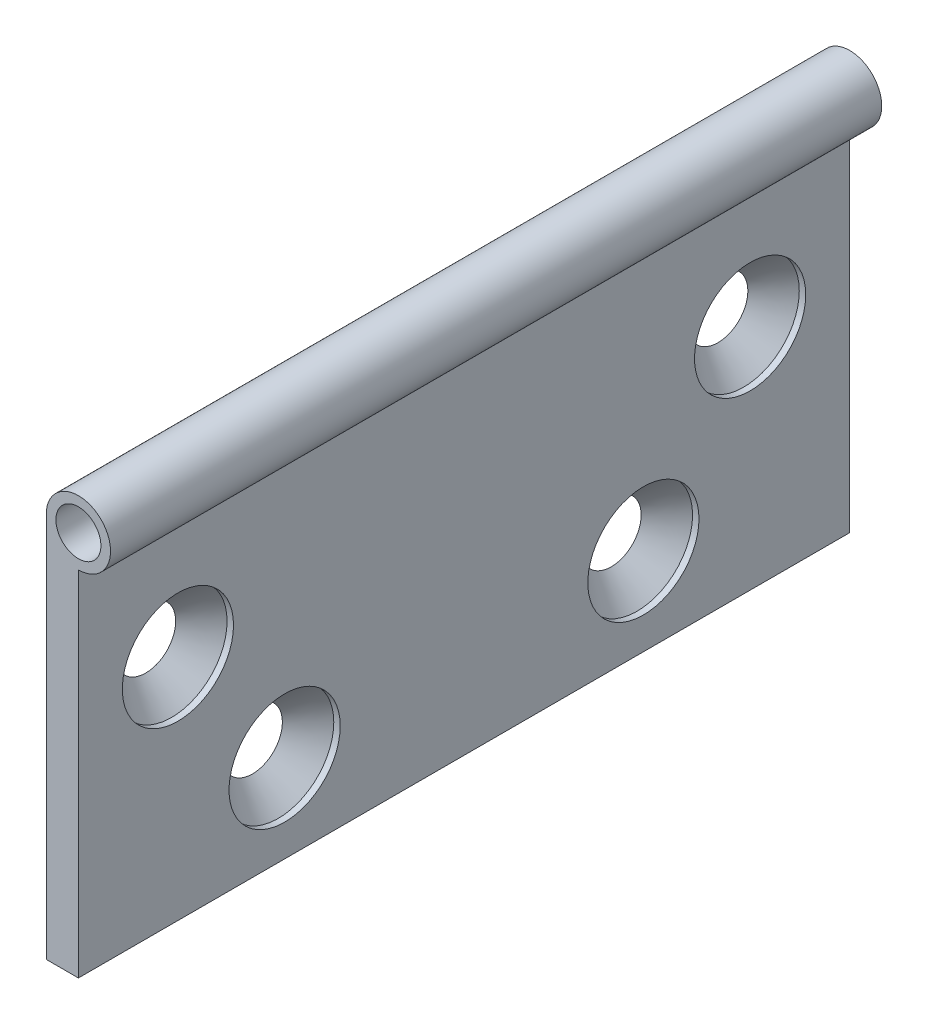
ISO-10303-21;
HEADER;
FILE_DESCRIPTION(('STEP AP214'),'2;1');
FILE_NAME('part.step','',(''),(''),'','','');
FILE_SCHEMA(('AUTOMOTIVE_DESIGN { 1 0 10303 214 1 1 1 1 }'));
ENDSEC;
DATA;
#1=APPLICATION_CONTEXT('core data for automotive mechanical design processes');
#2=APPLICATION_PROTOCOL_DEFINITION('international standard','automotive_design',2000,#1);
#3=PRODUCT_CONTEXT('',#1,'mechanical');
#4=PRODUCT('Part','Part','',(#3));
#5=PRODUCT_RELATED_PRODUCT_CATEGORY('part','',(#4));
#6=PRODUCT_DEFINITION_FORMATION('','',#4);
#7=PRODUCT_DEFINITION_CONTEXT('part definition',#1,'design');
#8=PRODUCT_DEFINITION('design','',#6,#7);
#9=PRODUCT_DEFINITION_SHAPE('','',#8);
#10=(LENGTH_UNIT() NAMED_UNIT(*) SI_UNIT(.MILLI.,.METRE.));
#11=(NAMED_UNIT(*) PLANE_ANGLE_UNIT() SI_UNIT($,.RADIAN.));
#12=(NAMED_UNIT(*) SI_UNIT($,.STERADIAN.) SOLID_ANGLE_UNIT());
#13=UNCERTAINTY_MEASURE_WITH_UNIT(LENGTH_MEASURE(1.E-05),#10,'distance_accuracy_value','');
#14=(GEOMETRIC_REPRESENTATION_CONTEXT(3) GLOBAL_UNCERTAINTY_ASSIGNED_CONTEXT((#13)) GLOBAL_UNIT_ASSIGNED_CONTEXT((#10,
#11,#12)) REPRESENTATION_CONTEXT('',''));
#15=CARTESIAN_POINT('',(0.,0.,0.));
#16=DIRECTION('',(0.,0.,1.));
#17=DIRECTION('',(1.,0.,0.));
#18=AXIS2_PLACEMENT_3D('',#15,#16,#17);
#19=CARTESIAN_POINT('',(5.,0.,60.));
#20=DIRECTION('',(-1.,0.,0.));
#21=DIRECTION('',(0.,0.,1.));
#22=AXIS2_PLACEMENT_3D('',#19,#20,#21);
#23=PLANE('',#22);
#24=CARTESIAN_POINT('',(5.,35.5059701868958,-44.5169870535529));
#25=DIRECTION('',(1.,0.,0.));
#26=DIRECTION('',(0.,0.,-1.));
#27=AXIS2_PLACEMENT_3D('',#24,#25,#26);
#28=CIRCLE('',#27,8.65);
#29=CARTESIAN_POINT('',(5.,35.5059701868958,-53.1669870535529));
#30=VERTEX_POINT('',#29);
#31=EDGE_CURVE('E177',#30,#30,#28,.T.);
#32=ORIENTED_EDGE('',*,*,#31,.F.);
#33=EDGE_LOOP('',(#32));
#34=FACE_BOUND('',#33,.T.);
#35=CARTESIAN_POINT('',(5.,13.6053302537975,-27.9125803068901));
#36=DIRECTION('',(1.,0.,0.));
#37=DIRECTION('',(0.,0.,-1.));
#38=AXIS2_PLACEMENT_3D('',#35,#36,#37);
#39=CIRCLE('',#38,8.65);
#40=CARTESIAN_POINT('',(5.,13.6053302537975,-36.5625803068901));
#41=VERTEX_POINT('',#40);
#42=EDGE_CURVE('E116',#41,#41,#39,.T.);
#43=ORIENTED_EDGE('',*,*,#42,.F.);
#44=EDGE_LOOP('',(#43));
#45=FACE_BOUND('',#44,.T.);
#46=CARTESIAN_POINT('',(5.,35.5059701868958,44.5169870535529));
#47=DIRECTION('',(1.,0.,0.));
#48=DIRECTION('',(0.,0.,-1.));
#49=AXIS2_PLACEMENT_3D('',#46,#47,#48);
#50=CIRCLE('',#49,8.65);
#51=CARTESIAN_POINT('',(5.,35.5059701868958,35.8669870535529));
#52=VERTEX_POINT('',#51);
#53=EDGE_CURVE('E109',#52,#52,#50,.T.);
#54=ORIENTED_EDGE('',*,*,#53,.F.);
#55=EDGE_LOOP('',(#54));
#56=FACE_BOUND('',#55,.T.);
#57=CARTESIAN_POINT('',(5.,13.6053302537975,27.9125803068901));
#58=DIRECTION('',(1.,0.,0.));
#59=DIRECTION('',(0.,0.,-1.));
#60=AXIS2_PLACEMENT_3D('',#57,#58,#59);
#61=CIRCLE('',#60,8.65);
#62=CARTESIAN_POINT('',(5.,13.6053302537975,19.2625803068901));
#63=VERTEX_POINT('',#62);
#64=EDGE_CURVE('E105',#63,#63,#61,.T.);
#65=ORIENTED_EDGE('',*,*,#64,.F.);
#66=EDGE_LOOP('',(#65));
#67=FACE_BOUND('',#66,.T.);
#68=DIRECTION('',(0.,0.,-1.));
#69=VECTOR('',#68,1.);
#70=CARTESIAN_POINT('',(5.,55.0000000000001,60.));
#71=LINE('',#70,#69);
#72=CARTESIAN_POINT('',(5.,55.0000000000001,60.));
#73=VERTEX_POINT('',#72);
#74=CARTESIAN_POINT('',(5.,55.0000000000001,-60.));
#75=VERTEX_POINT('',#74);
#76=EDGE_CURVE('E89',#73,#75,#71,.T.);
#77=ORIENTED_EDGE('',*,*,#76,.F.);
#78=DIRECTION('',(0.,1.,0.));
#79=VECTOR('',#78,1.);
#80=CARTESIAN_POINT('',(5.,0.,60.));
#81=LINE('',#80,#79);
#82=CARTESIAN_POINT('',(5.,0.,60.));
#83=VERTEX_POINT('',#82);
#84=EDGE_CURVE('E77',#83,#73,#81,.T.);
#85=ORIENTED_EDGE('',*,*,#84,.F.);
#86=DIRECTION('',(0.,0.,-1.));
#87=VECTOR('',#86,1.);
#88=CARTESIAN_POINT('',(5.,0.,60.));
#89=LINE('',#88,#87);
#90=CARTESIAN_POINT('',(5.,0.,-60.));
#91=VERTEX_POINT('',#90);
#92=EDGE_CURVE('E58',#83,#91,#89,.T.);
#93=ORIENTED_EDGE('',*,*,#92,.T.);
#94=DIRECTION('',(0.,1.,0.));
#95=VECTOR('',#94,1.);
#96=CARTESIAN_POINT('',(5.,0.,-60.));
#97=LINE('',#96,#95);
#98=EDGE_CURVE('E75',#91,#75,#97,.T.);
#99=ORIENTED_EDGE('',*,*,#98,.T.);
#100=EDGE_LOOP('',(#77,#85,#93,#99));
#101=FACE_BOUND('',#100,.T.);
#102=ADVANCED_FACE('F40',(#34,#45,#56,#67,#101),#23,.F.);
#103=CARTESIAN_POINT('',(0.,0.,60.));
#104=DIRECTION('',(-1.,0.,0.));
#105=DIRECTION('',(0.,0.,1.));
#106=AXIS2_PLACEMENT_3D('',#103,#104,#105);
#107=PLANE('',#106);
#108=CARTESIAN_POINT('',(0.,35.5059701868958,-44.5169870535529));
#109=DIRECTION('',(-1.,0.,0.));
#110=DIRECTION('',(0.,0.,1.));
#111=AXIS2_PLACEMENT_3D('',#108,#109,#110);
#112=CIRCLE('',#111,4.64999999999999);
#113=CARTESIAN_POINT('',(0.,35.5059701868958,-39.8669870535529));
#114=VERTEX_POINT('',#113);
#115=EDGE_CURVE('E43',#114,#114,#112,.T.);
#116=ORIENTED_EDGE('',*,*,#115,.F.);
#117=EDGE_LOOP('',(#116));
#118=FACE_BOUND('',#117,.T.);
#119=CARTESIAN_POINT('',(0.,13.6053302537975,-27.9125803068901));
#120=DIRECTION('',(-1.,0.,0.));
#121=DIRECTION('',(0.,0.,1.));
#122=AXIS2_PLACEMENT_3D('',#119,#120,#121);
#123=CIRCLE('',#122,4.65);
#124=CARTESIAN_POINT('',(0.,13.6053302537975,-23.2625803068901));
#125=VERTEX_POINT('',#124);
#126=EDGE_CURVE('E107',#125,#125,#123,.T.);
#127=ORIENTED_EDGE('',*,*,#126,.F.);
#128=EDGE_LOOP('',(#127));
#129=FACE_BOUND('',#128,.T.);
#130=CARTESIAN_POINT('',(0.,35.5059701868958,44.5169870535529));
#131=DIRECTION('',(-1.,0.,0.));
#132=DIRECTION('',(0.,0.,1.));
#133=AXIS2_PLACEMENT_3D('',#130,#131,#132);
#134=CIRCLE('',#133,4.64999999999999);
#135=CARTESIAN_POINT('',(0.,35.5059701868958,49.1669870535529));
#136=VERTEX_POINT('',#135);
#137=EDGE_CURVE('E103',#136,#136,#134,.T.);
#138=ORIENTED_EDGE('',*,*,#137,.F.);
#139=EDGE_LOOP('',(#138));
#140=FACE_BOUND('',#139,.T.);
#141=CARTESIAN_POINT('',(0.,13.6053302537975,27.9125803068901));
#142=DIRECTION('',(-1.,0.,0.));
#143=DIRECTION('',(0.,0.,1.));
#144=AXIS2_PLACEMENT_3D('',#141,#142,#143);
#145=CIRCLE('',#144,4.65);
#146=CARTESIAN_POINT('',(0.,13.6053302537975,32.5625803068901));
#147=VERTEX_POINT('',#146);
#148=EDGE_CURVE('E98',#147,#147,#145,.T.);
#149=ORIENTED_EDGE('',*,*,#148,.F.);
#150=EDGE_LOOP('',(#149));
#151=FACE_BOUND('',#150,.T.);
#152=DIRECTION('',(0.,1.,0.));
#153=VECTOR('',#152,1.);
#154=CARTESIAN_POINT('',(0.,0.,-60.));
#155=LINE('',#154,#153);
#156=CARTESIAN_POINT('',(0.,0.,-60.));
#157=VERTEX_POINT('',#156);
#158=CARTESIAN_POINT('',(0.,60.0000000000001,-60.));
#159=VERTEX_POINT('',#158);
#160=EDGE_CURVE('E88',#157,#159,#155,.T.);
#161=ORIENTED_EDGE('',*,*,#160,.F.);
#162=DIRECTION('',(0.,0.,-1.));
#163=VECTOR('',#162,1.);
#164=CARTESIAN_POINT('',(0.,0.,60.));
#165=LINE('',#164,#163);
#166=CARTESIAN_POINT('',(0.,0.,60.));
#167=VERTEX_POINT('',#166);
#168=EDGE_CURVE('E49',#167,#157,#165,.T.);
#169=ORIENTED_EDGE('',*,*,#168,.F.);
#170=DIRECTION('',(0.,1.,0.));
#171=VECTOR('',#170,1.);
#172=CARTESIAN_POINT('',(0.,0.,60.));
#173=LINE('',#172,#171);
#174=CARTESIAN_POINT('',(0.,60.0000000000001,60.));
#175=VERTEX_POINT('',#174);
#176=EDGE_CURVE('E93',#167,#175,#173,.T.);
#177=ORIENTED_EDGE('',*,*,#176,.T.);
#178=DIRECTION('',(0.,0.,-1.));
#179=VECTOR('',#178,1.);
#180=CARTESIAN_POINT('',(0.,60.0000000000001,60.));
#181=LINE('',#180,#179);
#182=EDGE_CURVE('E11',#175,#159,#181,.T.);
#183=ORIENTED_EDGE('',*,*,#182,.T.);
#184=EDGE_LOOP('',(#161,#169,#177,#183));
#185=FACE_BOUND('',#184,.T.);
#186=ADVANCED_FACE('F149',(#118,#129,#140,#151,#185),#107,.T.);
#187=CARTESIAN_POINT('',(5.,0.,60.));
#188=DIRECTION('',(0.,-1.,0.));
#189=DIRECTION('',(0.,0.,-1.));
#190=AXIS2_PLACEMENT_3D('',#187,#188,#189);
#191=PLANE('',#190);
#192=DIRECTION('',(-1.,0.,0.));
#193=VECTOR('',#192,1.);
#194=CARTESIAN_POINT('',(5.,0.,-60.));
#195=LINE('',#194,#193);
#196=EDGE_CURVE('E86',#91,#157,#195,.T.);
#197=ORIENTED_EDGE('',*,*,#196,.F.);
#198=ORIENTED_EDGE('',*,*,#92,.F.);
#199=DIRECTION('',(-1.,0.,0.));
#200=VECTOR('',#199,1.);
#201=CARTESIAN_POINT('',(5.,0.,60.));
#202=LINE('',#201,#200);
#203=EDGE_CURVE('E79',#83,#167,#202,.T.);
#204=ORIENTED_EDGE('',*,*,#203,.T.);
#205=ORIENTED_EDGE('',*,*,#168,.T.);
#206=EDGE_LOOP('',(#197,#198,#204,#205));
#207=FACE_BOUND('',#206,.T.);
#208=ADVANCED_FACE('F91',(#207),#191,.T.);
#209=CARTESIAN_POINT('',(0.,0.,60.));
#210=DIRECTION('',(0.,0.,-1.));
#211=DIRECTION('',(-1.,0.,0.));
#212=AXIS2_PLACEMENT_3D('',#209,#210,#211);
#213=PLANE('',#212);
#214=CARTESIAN_POINT('',(5.,60.0000000000001,60.));
#215=DIRECTION('',(0.,0.,1.));
#216=DIRECTION('',(1.,0.,0.));
#217=AXIS2_PLACEMENT_3D('',#214,#215,#216);
#218=CIRCLE('',#217,3.5);
#219=CARTESIAN_POINT('',(8.5,60.0000000000001,60.));
#220=VERTEX_POINT('',#219);
#221=EDGE_CURVE('E101',#220,#220,#218,.T.);
#222=ORIENTED_EDGE('',*,*,#221,.F.);
#223=EDGE_LOOP('',(#222));
#224=FACE_BOUND('',#223,.T.);
#225=ORIENTED_EDGE('',*,*,#84,.T.);
#226=CARTESIAN_POINT('',(5.,60.0000000000001,60.));
#227=DIRECTION('',(0.,0.,1.));
#228=DIRECTION('',(1.,0.,0.));
#229=AXIS2_PLACEMENT_3D('',#226,#227,#228);
#230=CIRCLE('',#229,5.);
#231=EDGE_CURVE('E133',#73,#175,#230,.T.);
#232=ORIENTED_EDGE('',*,*,#231,.T.);
#233=ORIENTED_EDGE('',*,*,#176,.F.);
#234=ORIENTED_EDGE('',*,*,#203,.F.);
#235=EDGE_LOOP('',(#225,#232,#233,#234));
#236=FACE_BOUND('',#235,.T.);
#237=ADVANCED_FACE('F145',(#224,#236),#213,.F.);
#238=CARTESIAN_POINT('',(0.,0.,-60.));
#239=DIRECTION('',(0.,0.,-1.));
#240=DIRECTION('',(-1.,0.,0.));
#241=AXIS2_PLACEMENT_3D('',#238,#239,#240);
#242=PLANE('',#241);
#243=CARTESIAN_POINT('',(5.,60.0000000000001,-60.));
#244=DIRECTION('',(0.,0.,1.));
#245=DIRECTION('',(1.,0.,0.));
#246=AXIS2_PLACEMENT_3D('',#243,#244,#245);
#247=CIRCLE('',#246,3.5);
#248=CARTESIAN_POINT('',(8.5,60.0000000000001,-60.));
#249=VERTEX_POINT('',#248);
#250=EDGE_CURVE('E130',#249,#249,#247,.T.);
#251=ORIENTED_EDGE('',*,*,#250,.T.);
#252=EDGE_LOOP('',(#251));
#253=FACE_BOUND('',#252,.T.);
#254=ORIENTED_EDGE('',*,*,#160,.T.);
#255=CARTESIAN_POINT('',(5.,60.0000000000001,-60.));
#256=DIRECTION('',(0.,0.,1.));
#257=DIRECTION('',(1.,0.,0.));
#258=AXIS2_PLACEMENT_3D('',#255,#256,#257);
#259=CIRCLE('',#258,5.);
#260=EDGE_CURVE('E87',#75,#159,#259,.T.);
#261=ORIENTED_EDGE('',*,*,#260,.F.);
#262=ORIENTED_EDGE('',*,*,#98,.F.);
#263=ORIENTED_EDGE('',*,*,#196,.T.);
#264=EDGE_LOOP('',(#254,#261,#262,#263));
#265=FACE_BOUND('',#264,.T.);
#266=ADVANCED_FACE('F85',(#253,#265),#242,.T.);
#267=CARTESIAN_POINT('',(5.,60.0000000000001,60.));
#268=DIRECTION('',(0.,0.,-1.));
#269=DIRECTION('',(-1.,0.,0.));
#270=AXIS2_PLACEMENT_3D('',#267,#268,#269);
#271=CYLINDRICAL_SURFACE('',#270,5.);
#272=ORIENTED_EDGE('',*,*,#231,.F.);
#273=ORIENTED_EDGE('',*,*,#76,.T.);
#274=ORIENTED_EDGE('',*,*,#260,.T.);
#275=ORIENTED_EDGE('',*,*,#182,.F.);
#276=EDGE_LOOP('',(#272,#273,#274,#275));
#277=FACE_BOUND('',#276,.T.);
#278=ADVANCED_FACE('F154',(#277),#271,.T.);
#279=CARTESIAN_POINT('',(5.,60.0000000000001,-60.));
#280=DIRECTION('',(0.,0.,1.));
#281=DIRECTION('',(1.,0.,0.));
#282=AXIS2_PLACEMENT_3D('',#279,#280,#281);
#283=CYLINDRICAL_SURFACE('',#282,3.5);
#284=ORIENTED_EDGE('',*,*,#250,.F.);
#285=EDGE_LOOP('',(#284));
#286=FACE_BOUND('',#285,.T.);
#287=ORIENTED_EDGE('',*,*,#221,.T.);
#288=EDGE_LOOP('',(#287));
#289=FACE_BOUND('',#288,.T.);
#290=ADVANCED_FACE('F156',(#286,#289),#283,.F.);
#291=CARTESIAN_POINT('',(4.,13.6053302537975,27.9125803068901));
#292=DIRECTION('',(1.,0.,0.));
#293=DIRECTION('',(0.,0.,-1.));
#294=AXIS2_PLACEMENT_3D('',#291,#292,#293);
#295=CONICAL_SURFACE('',#294,8.65,0.785398163397448);
#296=ORIENTED_EDGE('',*,*,#148,.T.);
#297=EDGE_LOOP('',(#296));
#298=FACE_BOUND('',#297,.T.);
#299=CARTESIAN_POINT('',(4.,13.6053302537975,27.9125803068901));
#300=DIRECTION('',(1.,0.,0.));
#301=DIRECTION('',(0.,0.,-1.));
#302=AXIS2_PLACEMENT_3D('',#299,#300,#301);
#303=CIRCLE('',#302,8.65);
#304=CARTESIAN_POINT('',(4.,13.6053302537975,19.2625803068901));
#305=VERTEX_POINT('',#304);
#306=EDGE_CURVE('E102',#305,#305,#303,.T.);
#307=ORIENTED_EDGE('',*,*,#306,.T.);
#308=EDGE_LOOP('',(#307));
#309=FACE_BOUND('',#308,.T.);
#310=ADVANCED_FACE('F162',(#298,#309),#295,.F.);
#311=CARTESIAN_POINT('',(5.,13.6053302537975,27.9125803068901));
#312=DIRECTION('',(1.,0.,0.));
#313=DIRECTION('',(0.,0.,-1.));
#314=AXIS2_PLACEMENT_3D('',#311,#312,#313);
#315=CYLINDRICAL_SURFACE('',#314,8.65);
#316=ORIENTED_EDGE('',*,*,#306,.F.);
#317=EDGE_LOOP('',(#316));
#318=FACE_BOUND('',#317,.T.);
#319=ORIENTED_EDGE('',*,*,#64,.T.);
#320=EDGE_LOOP('',(#319));
#321=FACE_BOUND('',#320,.T.);
#322=ADVANCED_FACE('F184',(#318,#321),#315,.F.);
#323=CARTESIAN_POINT('',(4.,35.5059701868958,44.5169870535529));
#324=DIRECTION('',(1.,0.,0.));
#325=DIRECTION('',(0.,0.,-1.));
#326=AXIS2_PLACEMENT_3D('',#323,#324,#325);
#327=CONICAL_SURFACE('',#326,8.65,0.785398163397449);
#328=ORIENTED_EDGE('',*,*,#137,.T.);
#329=EDGE_LOOP('',(#328));
#330=FACE_BOUND('',#329,.T.);
#331=CARTESIAN_POINT('',(4.,35.5059701868958,44.5169870535529));
#332=DIRECTION('',(1.,0.,0.));
#333=DIRECTION('',(0.,0.,-1.));
#334=AXIS2_PLACEMENT_3D('',#331,#332,#333);
#335=CIRCLE('',#334,8.65);
#336=CARTESIAN_POINT('',(4.,35.5059701868958,35.8669870535529));
#337=VERTEX_POINT('',#336);
#338=EDGE_CURVE('E106',#337,#337,#335,.T.);
#339=ORIENTED_EDGE('',*,*,#338,.T.);
#340=EDGE_LOOP('',(#339));
#341=FACE_BOUND('',#340,.T.);
#342=ADVANCED_FACE('F186',(#330,#341),#327,.F.);
#343=CARTESIAN_POINT('',(5.,35.5059701868958,44.5169870535529));
#344=DIRECTION('',(1.,0.,0.));
#345=DIRECTION('',(0.,0.,-1.));
#346=AXIS2_PLACEMENT_3D('',#343,#344,#345);
#347=CYLINDRICAL_SURFACE('',#346,8.65);
#348=ORIENTED_EDGE('',*,*,#338,.F.);
#349=EDGE_LOOP('',(#348));
#350=FACE_BOUND('',#349,.T.);
#351=ORIENTED_EDGE('',*,*,#53,.T.);
#352=EDGE_LOOP('',(#351));
#353=FACE_BOUND('',#352,.T.);
#354=ADVANCED_FACE('F193',(#350,#353),#347,.F.);
#355=CARTESIAN_POINT('',(4.,13.6053302537975,-27.9125803068901));
#356=DIRECTION('',(1.,0.,0.));
#357=DIRECTION('',(0.,0.,-1.));
#358=AXIS2_PLACEMENT_3D('',#355,#356,#357);
#359=CONICAL_SURFACE('',#358,8.65,0.785398163397448);
#360=ORIENTED_EDGE('',*,*,#126,.T.);
#361=EDGE_LOOP('',(#360));
#362=FACE_BOUND('',#361,.T.);
#363=CARTESIAN_POINT('',(4.,13.6053302537975,-27.9125803068901));
#364=DIRECTION('',(1.,0.,0.));
#365=DIRECTION('',(0.,0.,-1.));
#366=AXIS2_PLACEMENT_3D('',#363,#364,#365);
#367=CIRCLE('',#366,8.65);
#368=CARTESIAN_POINT('',(4.,13.6053302537975,-36.5625803068901));
#369=VERTEX_POINT('',#368);
#370=EDGE_CURVE('E110',#369,#369,#367,.T.);
#371=ORIENTED_EDGE('',*,*,#370,.T.);
#372=EDGE_LOOP('',(#371));
#373=FACE_BOUND('',#372,.T.);
#374=ADVANCED_FACE('F202',(#362,#373),#359,.F.);
#375=CARTESIAN_POINT('',(5.,13.6053302537975,-27.9125803068901));
#376=DIRECTION('',(1.,0.,0.));
#377=DIRECTION('',(0.,0.,-1.));
#378=AXIS2_PLACEMENT_3D('',#375,#376,#377);
#379=CYLINDRICAL_SURFACE('',#378,8.65);
#380=ORIENTED_EDGE('',*,*,#370,.F.);
#381=EDGE_LOOP('',(#380));
#382=FACE_BOUND('',#381,.T.);
#383=ORIENTED_EDGE('',*,*,#42,.T.);
#384=EDGE_LOOP('',(#383));
#385=FACE_BOUND('',#384,.T.);
#386=ADVANCED_FACE('F206',(#382,#385),#379,.F.);
#387=CARTESIAN_POINT('',(4.,35.5059701868958,-44.5169870535529));
#388=DIRECTION('',(1.,0.,0.));
#389=DIRECTION('',(0.,0.,-1.));
#390=AXIS2_PLACEMENT_3D('',#387,#388,#389);
#391=CONICAL_SURFACE('',#390,8.65,0.785398163397449);
#392=ORIENTED_EDGE('',*,*,#115,.T.);
#393=EDGE_LOOP('',(#392));
#394=FACE_BOUND('',#393,.T.);
#395=CARTESIAN_POINT('',(4.,35.5059701868958,-44.5169870535529));
#396=DIRECTION('',(1.,0.,0.));
#397=DIRECTION('',(0.,0.,-1.));
#398=AXIS2_PLACEMENT_3D('',#395,#396,#397);
#399=CIRCLE('',#398,8.65);
#400=CARTESIAN_POINT('',(4.,35.5059701868958,-53.1669870535529));
#401=VERTEX_POINT('',#400);
#402=EDGE_CURVE('E222',#401,#401,#399,.T.);
#403=ORIENTED_EDGE('',*,*,#402,.T.);
#404=EDGE_LOOP('',(#403));
#405=FACE_BOUND('',#404,.T.);
#406=ADVANCED_FACE('F209',(#394,#405),#391,.F.);
#407=CARTESIAN_POINT('',(5.,35.5059701868958,-44.5169870535529));
#408=DIRECTION('',(1.,0.,0.));
#409=DIRECTION('',(0.,0.,-1.));
#410=AXIS2_PLACEMENT_3D('',#407,#408,#409);
#411=CYLINDRICAL_SURFACE('',#410,8.65);
#412=ORIENTED_EDGE('',*,*,#402,.F.);
#413=EDGE_LOOP('',(#412));
#414=FACE_BOUND('',#413,.T.);
#415=ORIENTED_EDGE('',*,*,#31,.T.);
#416=EDGE_LOOP('',(#415));
#417=FACE_BOUND('',#416,.T.);
#418=ADVANCED_FACE('F213',(#414,#417),#411,.F.);
#419=CLOSED_SHELL('',(#102,#186,#208,#237,#266,#278,#290,#310,#322,#342,#354,#374,#386,#406,#418));
#420=MANIFOLD_SOLID_BREP('B2',#419);
#421=ADVANCED_BREP_SHAPE_REPRESENTATION('',(#18,#420),#14);
#422=SHAPE_DEFINITION_REPRESENTATION(#9,#421);
ENDSEC;
END-ISO-10303-21;
